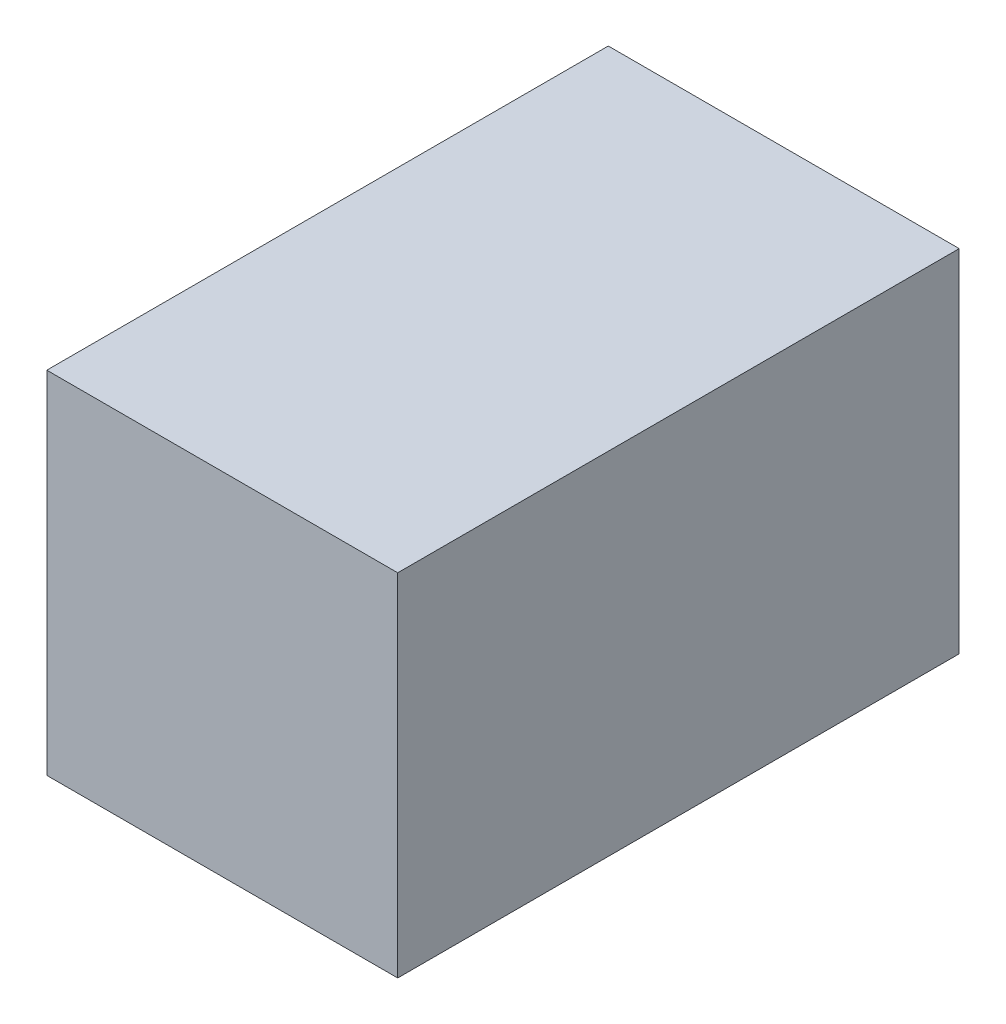
ISO-10303-21;
HEADER;
FILE_DESCRIPTION(('STEP AP214'),'2;1');
FILE_NAME('part.step','',(''),(''),'','','');
FILE_SCHEMA(('AUTOMOTIVE_DESIGN { 1 0 10303 214 1 1 1 1 }'));
ENDSEC;
DATA;
#1=APPLICATION_CONTEXT('core data for automotive mechanical design processes');
#2=APPLICATION_PROTOCOL_DEFINITION('international standard','automotive_design',2000,#1);
#3=PRODUCT_CONTEXT('',#1,'mechanical');
#4=PRODUCT('Part','Part','',(#3));
#5=PRODUCT_RELATED_PRODUCT_CATEGORY('part','',(#4));
#6=PRODUCT_DEFINITION_FORMATION('','',#4);
#7=PRODUCT_DEFINITION_CONTEXT('part definition',#1,'design');
#8=PRODUCT_DEFINITION('design','',#6,#7);
#9=PRODUCT_DEFINITION_SHAPE('','',#8);
#10=(LENGTH_UNIT() NAMED_UNIT(*) SI_UNIT(.MILLI.,.METRE.));
#11=(NAMED_UNIT(*) PLANE_ANGLE_UNIT() SI_UNIT($,.RADIAN.));
#12=(NAMED_UNIT(*) SI_UNIT($,.STERADIAN.) SOLID_ANGLE_UNIT());
#13=UNCERTAINTY_MEASURE_WITH_UNIT(LENGTH_MEASURE(1.E-05),#10,'distance_accuracy_value','');
#14=(GEOMETRIC_REPRESENTATION_CONTEXT(3) GLOBAL_UNCERTAINTY_ASSIGNED_CONTEXT((#13)) GLOBAL_UNIT_ASSIGNED_CONTEXT((#10,
#11,#12)) REPRESENTATION_CONTEXT('',''));
#15=CARTESIAN_POINT('',(0.,0.,0.));
#16=DIRECTION('',(0.,0.,1.));
#17=DIRECTION('',(1.,0.,0.));
#18=AXIS2_PLACEMENT_3D('',#15,#16,#17);
#19=CARTESIAN_POINT('',(0.5,1.,-0.800000000000001));
#20=DIRECTION('',(-1.,0.,0.));
#21=DIRECTION('',(0.,0.,1.));
#22=AXIS2_PLACEMENT_3D('',#19,#20,#21);
#23=PLANE('',#22);
#24=DIRECTION('',(0.,0.,-1.));
#25=VECTOR('',#24,1.);
#26=CARTESIAN_POINT('',(0.5,0.,-0.800000000000001));
#27=LINE('',#26,#25);
#28=CARTESIAN_POINT('',(0.5,0.,0.799999999999999));
#29=VERTEX_POINT('',#28);
#30=CARTESIAN_POINT('',(0.5,0.,-0.800000000000001));
#31=VERTEX_POINT('',#30);
#32=EDGE_CURVE('E106',#29,#31,#27,.T.);
#33=ORIENTED_EDGE('',*,*,#32,.T.);
#34=DIRECTION('',(0.,-1.,0.));
#35=VECTOR('',#34,1.);
#36=CARTESIAN_POINT('',(0.5,1.,-0.800000000000001));
#37=LINE('',#36,#35);
#38=CARTESIAN_POINT('',(0.5,1.,-0.800000000000001));
#39=VERTEX_POINT('',#38);
#40=EDGE_CURVE('E11',#39,#31,#37,.T.);
#41=ORIENTED_EDGE('',*,*,#40,.F.);
#42=DIRECTION('',(0.,0.,-1.));
#43=VECTOR('',#42,1.);
#44=CARTESIAN_POINT('',(0.5,1.,-0.800000000000001));
#45=LINE('',#44,#43);
#46=CARTESIAN_POINT('',(0.5,1.,0.799999999999999));
#47=VERTEX_POINT('',#46);
#48=EDGE_CURVE('E94',#47,#39,#45,.T.);
#49=ORIENTED_EDGE('',*,*,#48,.F.);
#50=DIRECTION('',(0.,-1.,0.));
#51=VECTOR('',#50,1.);
#52=CARTESIAN_POINT('',(0.5,1.,0.799999999999999));
#53=LINE('',#52,#51);
#54=EDGE_CURVE('E102',#47,#29,#53,.T.);
#55=ORIENTED_EDGE('',*,*,#54,.T.);
#56=EDGE_LOOP('',(#33,#41,#49,#55));
#57=FACE_BOUND('',#56,.T.);
#58=ADVANCED_FACE('F43',(#57),#23,.F.);
#59=CARTESIAN_POINT('',(-0.5,1.,-0.800000000000001));
#60=DIRECTION('',(0.,0.,1.));
#61=DIRECTION('',(1.,0.,0.));
#62=AXIS2_PLACEMENT_3D('',#59,#60,#61);
#63=PLANE('',#62);
#64=DIRECTION('',(-1.,0.,0.));
#65=VECTOR('',#64,1.);
#66=CARTESIAN_POINT('',(-0.5,0.,-0.800000000000001));
#67=LINE('',#66,#65);
#68=CARTESIAN_POINT('',(-0.5,0.,-0.800000000000001));
#69=VERTEX_POINT('',#68);
#70=EDGE_CURVE('E98',#31,#69,#67,.T.);
#71=ORIENTED_EDGE('',*,*,#70,.T.);
#72=DIRECTION('',(0.,-1.,0.));
#73=VECTOR('',#72,1.);
#74=CARTESIAN_POINT('',(-0.5,1.,-0.800000000000001));
#75=LINE('',#74,#73);
#76=CARTESIAN_POINT('',(-0.5,1.,-0.800000000000001));
#77=VERTEX_POINT('',#76);
#78=EDGE_CURVE('E51',#77,#69,#75,.T.);
#79=ORIENTED_EDGE('',*,*,#78,.F.);
#80=DIRECTION('',(-1.,0.,0.));
#81=VECTOR('',#80,1.);
#82=CARTESIAN_POINT('',(-0.5,1.,-0.800000000000001));
#83=LINE('',#82,#81);
#84=EDGE_CURVE('E89',#39,#77,#83,.T.);
#85=ORIENTED_EDGE('',*,*,#84,.F.);
#86=ORIENTED_EDGE('',*,*,#40,.T.);
#87=EDGE_LOOP('',(#71,#79,#85,#86));
#88=FACE_BOUND('',#87,.T.);
#89=ADVANCED_FACE('F97',(#88),#63,.F.);
#90=CARTESIAN_POINT('',(-0.5,1.,-0.800000000000001));
#91=DIRECTION('',(1.,0.,0.));
#92=DIRECTION('',(0.,0.,-1.));
#93=AXIS2_PLACEMENT_3D('',#90,#91,#92);
#94=PLANE('',#93);
#95=DIRECTION('',(0.,0.,1.));
#96=VECTOR('',#95,1.);
#97=CARTESIAN_POINT('',(-0.5,0.,-0.800000000000001));
#98=LINE('',#97,#96);
#99=CARTESIAN_POINT('',(-0.5,0.,0.799999999999999));
#100=VERTEX_POINT('',#99);
#101=EDGE_CURVE('E76',#69,#100,#98,.T.);
#102=ORIENTED_EDGE('',*,*,#101,.T.);
#103=DIRECTION('',(0.,-1.,0.));
#104=VECTOR('',#103,1.);
#105=CARTESIAN_POINT('',(-0.5,1.,0.799999999999999));
#106=LINE('',#105,#104);
#107=CARTESIAN_POINT('',(-0.5,1.,0.799999999999999));
#108=VERTEX_POINT('',#107);
#109=EDGE_CURVE('E99',#108,#100,#106,.T.);
#110=ORIENTED_EDGE('',*,*,#109,.F.);
#111=DIRECTION('',(0.,0.,1.));
#112=VECTOR('',#111,1.);
#113=CARTESIAN_POINT('',(-0.5,1.,-0.800000000000001));
#114=LINE('',#113,#112);
#115=EDGE_CURVE('E92',#77,#108,#114,.T.);
#116=ORIENTED_EDGE('',*,*,#115,.F.);
#117=ORIENTED_EDGE('',*,*,#78,.T.);
#118=EDGE_LOOP('',(#102,#110,#116,#117));
#119=FACE_BOUND('',#118,.T.);
#120=ADVANCED_FACE('F100',(#119),#94,.F.);
#121=CARTESIAN_POINT('',(-0.5,1.,0.799999999999999));
#122=DIRECTION('',(0.,0.,-1.));
#123=DIRECTION('',(-1.,0.,0.));
#124=AXIS2_PLACEMENT_3D('',#121,#122,#123);
#125=PLANE('',#124);
#126=DIRECTION('',(1.,0.,0.));
#127=VECTOR('',#126,1.);
#128=CARTESIAN_POINT('',(-0.5,0.,0.799999999999999));
#129=LINE('',#128,#127);
#130=EDGE_CURVE('E82',#100,#29,#129,.T.);
#131=ORIENTED_EDGE('',*,*,#130,.T.);
#132=ORIENTED_EDGE('',*,*,#54,.F.);
#133=DIRECTION('',(1.,0.,0.));
#134=VECTOR('',#133,1.);
#135=CARTESIAN_POINT('',(-0.5,1.,0.799999999999999));
#136=LINE('',#135,#134);
#137=EDGE_CURVE('E59',#108,#47,#136,.T.);
#138=ORIENTED_EDGE('',*,*,#137,.F.);
#139=ORIENTED_EDGE('',*,*,#109,.T.);
#140=EDGE_LOOP('',(#131,#132,#138,#139));
#141=FACE_BOUND('',#140,.T.);
#142=ADVANCED_FACE('F113',(#141),#125,.F.);
#143=CARTESIAN_POINT('',(0.,1.,0.));
#144=DIRECTION('',(0.,1.,0.));
#145=DIRECTION('',(0.,0.,1.));
#146=AXIS2_PLACEMENT_3D('',#143,#144,#145);
#147=PLANE('',#146);
#148=ORIENTED_EDGE('',*,*,#48,.T.);
#149=ORIENTED_EDGE('',*,*,#84,.T.);
#150=ORIENTED_EDGE('',*,*,#115,.T.);
#151=ORIENTED_EDGE('',*,*,#137,.T.);
#152=EDGE_LOOP('',(#148,#149,#150,#151));
#153=FACE_BOUND('',#152,.T.);
#154=ADVANCED_FACE('F90',(#153),#147,.T.);
#155=CARTESIAN_POINT('',(0.,0.,0.));
#156=DIRECTION('',(0.,1.,0.));
#157=DIRECTION('',(0.,0.,1.));
#158=AXIS2_PLACEMENT_3D('',#155,#156,#157);
#159=PLANE('',#158);
#160=ORIENTED_EDGE('',*,*,#32,.F.);
#161=ORIENTED_EDGE('',*,*,#130,.F.);
#162=ORIENTED_EDGE('',*,*,#101,.F.);
#163=ORIENTED_EDGE('',*,*,#70,.F.);
#164=EDGE_LOOP('',(#160,#161,#162,#163));
#165=FACE_BOUND('',#164,.T.);
#166=ADVANCED_FACE('F116',(#165),#159,.F.);
#167=CLOSED_SHELL('',(#58,#89,#120,#142,#154,#166));
#168=MANIFOLD_SOLID_BREP('B2',#167);
#169=ADVANCED_BREP_SHAPE_REPRESENTATION('',(#18,#168),#14);
#170=SHAPE_DEFINITION_REPRESENTATION(#9,#169);
ENDSEC;
END-ISO-10303-21;
